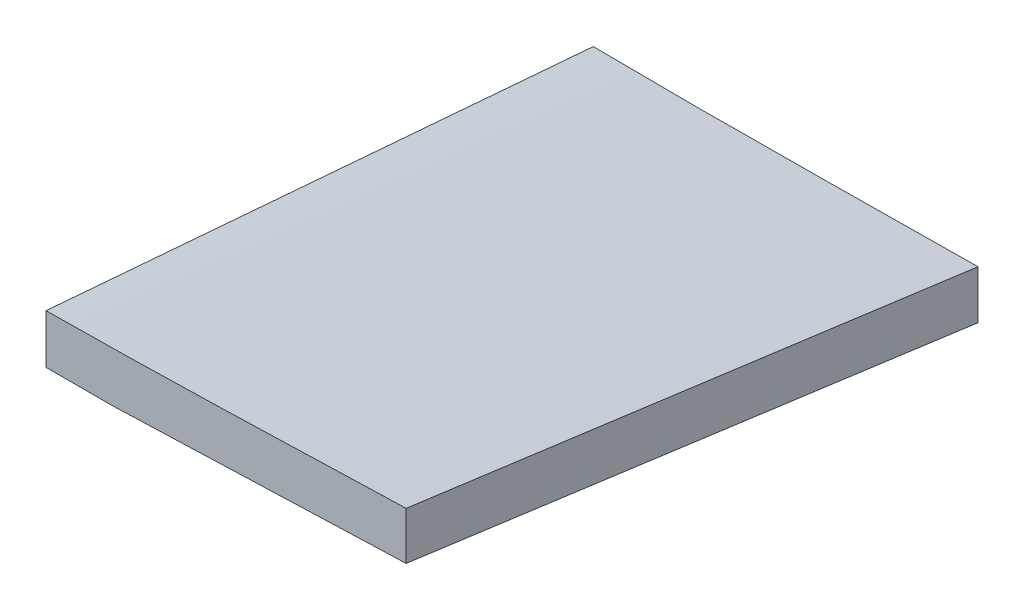
ISO-10303-21;
HEADER;
FILE_DESCRIPTION(('STEP AP214'),'2;1');
FILE_NAME('part.step','',(''),(''),'','','');
FILE_SCHEMA(('AUTOMOTIVE_DESIGN { 1 0 10303 214 1 1 1 1 }'));
ENDSEC;
DATA;
#1=APPLICATION_CONTEXT('core data for automotive mechanical design processes');
#2=APPLICATION_PROTOCOL_DEFINITION('international standard','automotive_design',2000,#1);
#3=PRODUCT_CONTEXT('',#1,'mechanical');
#4=PRODUCT('Part','Part','',(#3));
#5=PRODUCT_RELATED_PRODUCT_CATEGORY('part','',(#4));
#6=PRODUCT_DEFINITION_FORMATION('','',#4);
#7=PRODUCT_DEFINITION_CONTEXT('part definition',#1,'design');
#8=PRODUCT_DEFINITION('design','',#6,#7);
#9=PRODUCT_DEFINITION_SHAPE('','',#8);
#10=(LENGTH_UNIT() NAMED_UNIT(*) SI_UNIT(.MILLI.,.METRE.));
#11=(NAMED_UNIT(*) PLANE_ANGLE_UNIT() SI_UNIT($,.RADIAN.));
#12=(NAMED_UNIT(*) SI_UNIT($,.STERADIAN.) SOLID_ANGLE_UNIT());
#13=UNCERTAINTY_MEASURE_WITH_UNIT(LENGTH_MEASURE(1.E-05),#10,'distance_accuracy_value','');
#14=(GEOMETRIC_REPRESENTATION_CONTEXT(3) GLOBAL_UNCERTAINTY_ASSIGNED_CONTEXT((#13)) GLOBAL_UNIT_ASSIGNED_CONTEXT((#10,
#11,#12)) REPRESENTATION_CONTEXT('',''));
#15=CARTESIAN_POINT('',(0.,0.,0.));
#16=DIRECTION('',(0.,0.,1.));
#17=DIRECTION('',(1.,0.,0.));
#18=AXIS2_PLACEMENT_3D('',#15,#16,#17);
#19=CARTESIAN_POINT('',(122.012987748225,6.34998004884585,335.28));
#20=DIRECTION('',(1.,0.,0.));
#21=DIRECTION('',(0.,1.,0.));
#22=AXIS2_PLACEMENT_3D('',#19,#20,#21);
#23=PLANE('',#22);
#24=CARTESIAN_POINT('',(122.012987748225,-23.8937090007613,335.28));
#25=CARTESIAN_POINT('',(122.012987748225,-21.305492372462,368.512698449762));
#26=CARTESIAN_POINT('',(122.012987748225,-18.7176497078026,401.745426017167));
#27=CARTESIAN_POINT('',(122.012987748225,-15.0260938493232,449.158783166482));
#28=CARTESIAN_POINT('',(122.012987748225,-13.9220747822631,463.339388932419));
#29=CARTESIAN_POINT('',(122.012987748225,-12.8181238056028,477.520000000027));
#30=B_SPLINE_CURVE_WITH_KNOTS('',3,(#24,#25,#26,#27,#28,#29),.UNSPECIFIED.,.F.,.F.,(4,2,4),(0.,
100.000000005188,142.670551230878),.UNSPECIFIED.);
#31=CARTESIAN_POINT('',(122.012987748225,-23.8937090007613,335.28));
#32=VERTEX_POINT('',#31);
#33=CARTESIAN_POINT('',(122.012987748225,-12.8181238056028,477.520000000027));
#34=VERTEX_POINT('',#33);
#35=EDGE_CURVE('E111',#32,#34,#30,.T.);
#36=ORIENTED_EDGE('',*,*,#35,.T.);
#37=DIRECTION('',(0.,1.,0.));
#38=VECTOR('',#37,1.);
#39=CARTESIAN_POINT('',(122.012987748225,6.34998004884585,477.52));
#40=LINE('',#39,#38);
#41=CARTESIAN_POINT('',(122.012987748225,-0.0526370502863598,477.520000000027));
#42=VERTEX_POINT('',#41);
#43=EDGE_CURVE('E242',#34,#42,#40,.T.);
#44=ORIENTED_EDGE('',*,*,#43,.T.);
#45=CARTESIAN_POINT('',(122.012987748225,-0.0526370502863598,477.520000000027));
#46=CARTESIAN_POINT('',(122.012987748225,-1.99784415755209,453.813280448504));
#47=CARTESIAN_POINT('',(122.012987748225,-3.94337341776708,430.106587339408));
#48=CARTESIAN_POINT('',(122.012987748225,-7.83507624409556,382.693254006065));
#49=CARTESIAN_POINT('',(122.012987748225,-9.78124981020904,358.98661378182));
#50=CARTESIAN_POINT('',(122.012987748225,-11.7277455292718,335.28));
#51=B_SPLINE_CURVE_WITH_KNOTS('',3,(#45,#46,#47,#48,#49,#50),.UNSPECIFIED.,.F.,.F.,(4,2,4),(0.,
71.3591720834908,142.718344166981),.UNSPECIFIED.);
#52=CARTESIAN_POINT('',(122.012988297116,-11.727701160406,335.28));
#53=VERTEX_POINT('',#52);
#54=EDGE_CURVE('E106',#42,#53,#51,.T.);
#55=ORIENTED_EDGE('',*,*,#54,.T.);
#56=DIRECTION('',(0.,1.,0.));
#57=VECTOR('',#56,1.);
#58=CARTESIAN_POINT('',(122.012987748225,-11.515890039431,335.28));
#59=LINE('',#58,#57);
#60=EDGE_CURVE('E122',#32,#53,#59,.T.);
#61=ORIENTED_EDGE('',*,*,#60,.F.);
#62=EDGE_LOOP('',(#36,#44,#55,#61));
#63=FACE_BOUND('',#62,.T.);
#64=ADVANCED_FACE('F44',(#63),#23,.F.);
#65=CARTESIAN_POINT('',(0.,0.,477.52));
#66=DIRECTION('',(0.,0.,-1.));
#67=DIRECTION('',(-1.,0.,0.));
#68=AXIS2_PLACEMENT_3D('',#65,#66,#67);
#69=PLANE('',#68);
#70=DIRECTION('',(1.,0.,0.));
#71=VECTOR('',#70,1.);
#72=CARTESIAN_POINT('',(114.323209263802,-12.8181238056049,477.52));
#73=LINE('',#72,#71);
#74=CARTESIAN_POINT('',(139.3232092638,-12.8181238056026,477.520000000029));
#75=VERTEX_POINT('',#74);
#76=EDGE_CURVE('E233',#34,#75,#73,.T.);
#77=ORIENTED_EDGE('',*,*,#76,.T.);
#78=CARTESIAN_POINT('',(139.323209263802,-12.8181238056049,477.52));
#79=CARTESIAN_POINT('',(146.245514006947,-12.5759223842232,477.52));
#80=CARTESIAN_POINT('',(153.167818750092,-12.3337209628415,477.52));
#81=CARTESIAN_POINT('',(167.012428236382,-11.8493181200781,477.52));
#82=CARTESIAN_POINT('',(173.934732979527,-11.6071166986964,477.52));
#83=CARTESIAN_POINT('',(192.445330995778,-10.9594576723294,477.52));
#84=CARTESIAN_POINT('',(204.033624268884,-10.554000067344,477.52));
#85=CARTESIAN_POINT('',(215.621917541989,-10.1485424623587,477.52));
#86=B_SPLINE_CURVE_WITH_KNOTS('',3,(#78,#79,#80,#81,#82,#83,#84,#85),.UNSPECIFIED.,.F.,.F.,(4,2,
2,4),(0.,20.7796217571299,41.5592435142597,76.3453963868684),.UNSPECIFIED.);
#87=CARTESIAN_POINT('',(215.621917541989,-10.1485424623587,477.52));
#88=VERTEX_POINT('',#87);
#89=EDGE_CURVE('E117',#75,#88,#86,.T.);
#90=ORIENTED_EDGE('',*,*,#89,.T.);
#91=DIRECTION('',(0.,1.,0.));
#92=VECTOR('',#91,1.);
#93=CARTESIAN_POINT('',(215.62191754199,-23.8937090007613,477.52));
#94=LINE('',#93,#92);
#95=CARTESIAN_POINT('',(215.621917541989,2.25574454634471,477.52));
#96=VERTEX_POINT('',#95);
#97=EDGE_CURVE('E114',#88,#96,#94,.T.);
#98=ORIENTED_EDGE('',*,*,#97,.T.);
#99=CARTESIAN_POINT('',(215.621917541989,2.25574454634471,477.52));
#100=CARTESIAN_POINT('',(214.647044605365,2.224288392323,477.52));
#101=CARTESIAN_POINT('',(213.67216500944,2.19303949664612,477.52));
#102=CARTESIAN_POINT('',(211.722394914279,2.13088505525722,477.52));
#103=CARTESIAN_POINT('',(210.747504415045,2.09997950952898,477.52));
#104=CARTESIAN_POINT('',(208.797715604077,2.03844062258157,477.52));
#105=CARTESIAN_POINT('',(207.82281729235,2.00780728114808,477.52));
#106=CARTESIAN_POINT('',(205.873014622828,1.94673327865421,477.52));
#107=CARTESIAN_POINT('',(204.898110265033,1.91629261759682,477.52));
#108=CARTESIAN_POINT('',(201.973390033636,1.82523005415367,477.52));
#109=CARTESIAN_POINT('',(200.023566075061,1.76486754230643,477.52));
#110=CARTESIAN_POINT('',(196.123895541607,1.64489301308431,477.52));
#111=CARTESIAN_POINT('',(194.174048966735,1.58528099552785,477.52));
#112=CARTESIAN_POINT('',(190.274399309307,1.46677611513231,477.52));
#113=CARTESIAN_POINT('',(188.324596227481,1.40788322828511,477.52));
#114=CARTESIAN_POINT('',(184.42496974022,1.29073730791751,477.52));
#115=CARTESIAN_POINT('',(182.475146334773,1.23248427475644,477.52));
#116=CARTESIAN_POINT('',(179.550393645504,1.14566147571709,477.52));
#117=CARTESIAN_POINT('',(178.575472624049,1.1168133190096,477.52));
#118=CARTESIAN_POINT('',(176.625625349061,1.0592944631072,477.52));
#119=CARTESIAN_POINT('',(175.650699095529,1.0306237639128,477.52));
#120=CARTESIAN_POINT('',(172.725900323917,0.945169580461794,477.52));
#121=CARTESIAN_POINT('',(170.776011391535,0.888944118170222,477.52));
#122=CARTESIAN_POINT('',(166.875956369448,0.77899210724675,477.52));
#123=CARTESIAN_POINT('',(164.925790272231,0.72526582335519,477.52));
#124=CARTESIAN_POINT('',(161.025365213215,0.621389081226013,477.52));
#125=CARTESIAN_POINT('',(159.075106251561,0.571238617557935,477.52));
#126=CARTESIAN_POINT('',(155.174486893242,0.47532787099128,477.52));
#127=CARTESIAN_POINT('',(153.224126496968,0.429567572283645,477.52));
#128=CARTESIAN_POINT('',(149.323298336082,0.343127637481132,477.52));
#129=CARTESIAN_POINT('',(147.372830571813,0.30244798599696,477.52));
#130=CARTESIAN_POINT('',(143.471732392745,0.226864321897372,477.52));
#131=CARTESIAN_POINT('',(141.521101975046,0.191960458572466,477.52));
#132=CARTESIAN_POINT('',(137.619739338344,0.127837378134033,477.52));
#133=CARTESIAN_POINT('',(135.669007118928,0.098618186243909,477.52));
#134=CARTESIAN_POINT('',(131.767444825237,0.0457651582251589,477.52));
#135=CARTESIAN_POINT('',(129.81661475011,0.0221313848305931,477.52));
#136=CARTESIAN_POINT('',(126.890307741431,-0.00911154197840539,477.52));
#137=CARTESIAN_POINT('',(125.914852880334,-0.0188246312667157,477.52));
#138=CARTESIAN_POINT('',(123.963929885645,-0.0368154889645691,477.52));
#139=CARTESIAN_POINT('',(122.988461752051,-0.0450932573088259,477.52));
#140=CARTESIAN_POINT('',(122.012987748173,-0.052637050288963,477.52));
#141=B_SPLINE_CURVE_WITH_KNOTS('',3,(#99,#100,#101,#102,#103,#104,#105,#106,#107,#108,#109,#110,
#111,#112,#113,#114,#115,#116,#117,#118,#119,#120,#121,#122,#123,#124,#125,#126,#127,#128,#129,
#130,#131,#132,#133,#134,#135,#136,#137,#138,#139,#140),.UNSPECIFIED.,.F.,.F.,(4,2,2,2,2,2,2,2,
2,2,2,2,2,2,2,2,2,2,2,2,4),(0.,2.92614084149174,5.85228154467963,8.77841994370649,
11.7045583880756,17.5568324945537,23.4091051850171,29.2611819606866,35.1132620224934,
38.0393052238479,40.9653484336475,46.8174456482294,52.6701613758528,58.5228682149949,
64.375553977651,70.2282220120763,76.0810413005542,81.9338865579291,87.7867975499124,
90.7133063005583,93.6398151843176),.UNSPECIFIED.);
#142=EDGE_CURVE('E101',#96,#42,#141,.T.);
#143=ORIENTED_EDGE('',*,*,#142,.T.);
#144=ORIENTED_EDGE('',*,*,#43,.F.);
#145=EDGE_LOOP('',(#77,#90,#98,#143,#144));
#146=FACE_BOUND('',#145,.T.);
#147=ADVANCED_FACE('F116',(#146),#69,.F.);
#148=CARTESIAN_POINT('',(200.92741848358,-11.515890039431,335.28));
#149=DIRECTION('',(0.,0.,1.));
#150=DIRECTION('',(1.,0.,0.));
#151=AXIS2_PLACEMENT_3D('',#148,#149,#150);
#152=PLANE('',#151);
#153=DIRECTION('',(-1.,0.,0.));
#154=VECTOR('',#153,1.);
#155=CARTESIAN_POINT('',(148.93082104307,-23.8937090007613,335.28));
#156=LINE('',#155,#154);
#157=CARTESIAN_POINT('',(148.93082104307,-23.8937090007613,335.28));
#158=VERTEX_POINT('',#157);
#159=EDGE_CURVE('E164',#158,#32,#156,.T.);
#160=ORIENTED_EDGE('',*,*,#159,.T.);
#161=ORIENTED_EDGE('',*,*,#60,.T.);
#162=CARTESIAN_POINT('',(49.0219891897218,-9.05897370885618,335.28));
#163=CARTESIAN_POINT('',(52.7488075915908,-9.37968687905642,335.28));
#164=CARTESIAN_POINT('',(61.5486245889691,-10.0060219878456,335.28));
#165=CARTESIAN_POINT('',(75.4340137435764,-10.6804188841519,335.28));
#166=CARTESIAN_POINT('',(95.7508728354299,-11.2827277231481,335.28));
#167=CARTESIAN_POINT('',(121.162052376226,-11.7896131541079,335.28));
#168=CARTESIAN_POINT('',(150.889153507633,-11.9577234273644,335.28));
#169=CARTESIAN_POINT('',(170.450484189727,-11.8089552152556,335.28));
#170=CARTESIAN_POINT('',(179.841619958646,-11.723553664972,335.28));
#171=B_SPLINE_CURVE_WITH_KNOTS('',3,(#162,#163,#164,#165,#166,#167,#168,#169,#170),
.UNSPECIFIED.,.F.,.F.,(4,1,1,1,1,1,4),(0.589081134929683,0.607134741746914,0.631652079836766,
0.656174271859652,0.705233949250519,0.754320378530032,0.799648231212389),.UNSPECIFIED.);
#172=CARTESIAN_POINT('',(179.841619958646,-11.723553664972,335.28));
#173=VERTEX_POINT('',#172);
#174=EDGE_CURVE('E59',#53,#173,#171,.T.);
#175=ORIENTED_EDGE('',*,*,#174,.T.);
#176=CARTESIAN_POINT('',(179.841619958646,-11.723553664972,335.28));
#177=CARTESIAN_POINT('',(180.626661669914,-11.7164132247789,335.28));
#178=CARTESIAN_POINT('',(191.590298029477,-11.615327823903,335.28));
#179=CARTESIAN_POINT('',(205.647342909195,-11.4679823577632,335.28));
#180=CARTESIAN_POINT('',(218.919367509353,-11.3224017932494,335.28));
#181=CARTESIAN_POINT('',(222.012987748225,-11.2872773614073,335.28));
#182=B_SPLINE_CURVE_WITH_KNOTS('',3,(#176,#177,#178,#179,#180,#181),.UNSPECIFIED.,.F.,.F.,(4,1,
1,4),(0.79964823121239,0.803437363555032,0.852566095729537,0.867498350403516),.UNSPECIFIED.);
#183=CARTESIAN_POINT('',(222.012987748225,-11.2872773614074,335.28));
#184=VERTEX_POINT('',#183);
#185=EDGE_CURVE('E11',#173,#184,#182,.T.);
#186=ORIENTED_EDGE('',*,*,#185,.T.);
#187=DIRECTION('',(0.,-1.,0.));
#188=VECTOR('',#187,1.);
#189=CARTESIAN_POINT('',(222.012987748225,-11.2872773614074,335.28));
#190=LINE('',#189,#188);
#191=CARTESIAN_POINT('',(222.012987748225,-23.8937090007613,335.28));
#192=VERTEX_POINT('',#191);
#193=EDGE_CURVE('E73',#184,#192,#190,.T.);
#194=ORIENTED_EDGE('',*,*,#193,.T.);
#195=DIRECTION('',(-1.,0.,0.));
#196=VECTOR('',#195,1.);
#197=CARTESIAN_POINT('',(148.93082104307,-23.8937090007613,335.28));
#198=LINE('',#197,#196);
#199=EDGE_CURVE('E248',#192,#158,#198,.T.);
#200=ORIENTED_EDGE('',*,*,#199,.T.);
#201=EDGE_LOOP('',(#160,#161,#175,#186,#194,#200));
#202=FACE_BOUND('',#201,.T.);
#203=ADVANCED_FACE('F222',(#202),#152,.F.);
#204=CARTESIAN_POINT('',(222.012987748225,-23.8937090007613,335.28));
#205=DIRECTION('',(0.998992101682105,0.,0.0448863094581294));
#206=DIRECTION('',(0.,1.,0.));
#207=AXIS2_PLACEMENT_3D('',#204,#205,#206);
#208=PLANE('',#207);
#209=ORIENTED_EDGE('',*,*,#97,.F.);
#210=CARTESIAN_POINT('',(222.012987748225,-23.8937090007613,335.28));
#211=CARTESIAN_POINT('',(215.621950375233,-10.1464646900732,477.519269261564));
#212=CARTESIAN_POINT('',(209.230888497717,3.59504253956158,619.759083897143));
#213=CARTESIAN_POINT('',(202.839777129521,17.3249682784286,762.));
#214=B_SPLINE_CURVE_WITH_KNOTS('',3,(#210,#211,#212,#213),.UNSPECIFIED.,.F.,.F.,(4,4),(0.,1.),.UNSPECIFIED.);
#215=EDGE_CURVE('E127',#192,#88,#214,.T.);
#216=ORIENTED_EDGE('',*,*,#215,.F.);
#217=ORIENTED_EDGE('',*,*,#193,.F.);
#218=CARTESIAN_POINT('',(222.012987748225,-11.2872773614073,335.28));
#219=CARTESIAN_POINT('',(215.621950375233,2.25782306949605,477.519269261564));
#220=CARTESIAN_POINT('',(209.230888497717,15.7971864193462,619.759083897143));
#221=CARTESIAN_POINT('',(202.839777129521,29.3249682784286,762.));
#222=B_SPLINE_CURVE_WITH_KNOTS('',3,(#218,#219,#220,#221),.UNSPECIFIED.,.F.,.F.,(4,4),(0.,1.),.UNSPECIFIED.);
#223=EDGE_CURVE('E67',#184,#96,#222,.T.);
#224=ORIENTED_EDGE('',*,*,#223,.T.);
#225=EDGE_LOOP('',(#209,#216,#217,#224));
#226=FACE_BOUND('',#225,.T.);
#227=ADVANCED_FACE('F124',(#226),#208,.T.);
#228=CARTESIAN_POINT('',(148.93082104307,-23.8937090007613,335.28));
#229=CARTESIAN_POINT('',(139.323254044884,-12.8160361171643,477.519269261564));
#230=CARTESIAN_POINT('',(129.715662542174,-1.74410031462064,619.759083897143));
#231=CARTESIAN_POINT('',(120.108021548784,9.31625399715528,762.));
#232=CARTESIAN_POINT('',(155.021001601833,-23.8937090007613,335.28));
#233=CARTESIAN_POINT('',(145.68147873908,-12.5935718315734,477.519269261564));
#234=CARTESIAN_POINT('',(136.341931371802,-1.29917174343879,619.759083897143));
#235=CARTESIAN_POINT('',(127.002334513845,9.98364685392806,762.));
#236=CARTESIAN_POINT('',(167.201362719359,-23.8937090007613,335.28));
#237=CARTESIAN_POINT('',(158.397928127471,-12.1486432603916,477.519269261565));
#238=CARTESIAN_POINT('',(149.59446903106,-0.409314601075073,619.759083897144));
#239=CARTESIAN_POINT('',(140.790960443968,11.3184325674736,762.));
#240=CARTESIAN_POINT('',(185.471904395647,-23.8937090007613,335.28));
#241=CARTESIAN_POINT('',(177.472602210058,-11.4812504036188,477.519269261564));
#242=CARTESIAN_POINT('',(169.473275519945,0.925471112470457,619.759083897143));
#243=CARTESIAN_POINT('',(161.473899339152,13.3206111377919,762.));
#244=CARTESIAN_POINT('',(203.742446071936,-23.8937090007613,335.28));
#245=CARTESIAN_POINT('',(196.547276292646,-10.813857546846,477.519269261564));
#246=CARTESIAN_POINT('',(189.352082008831,2.26025682601603,619.759083897143));
#247=CARTESIAN_POINT('',(182.156838234336,15.3227897081103,761.999999999999));
#248=CARTESIAN_POINT('',(215.922807189462,-23.8937090007613,335.28));
#249=CARTESIAN_POINT('',(209.263725681037,-10.3689289756642,477.519269261564));
#250=CARTESIAN_POINT('',(202.604619668088,3.15011396837973,619.759083897143));
#251=CARTESIAN_POINT('',(195.945464164459,16.6575754216558,762.));
#252=CARTESIAN_POINT('',(222.012987748225,-23.8937090007613,335.28));
#253=CARTESIAN_POINT('',(215.621950375233,-10.1464646900732,477.519269261564));
#254=CARTESIAN_POINT('',(209.230888497717,3.59504253956158,619.759083897143));
#255=CARTESIAN_POINT('',(202.839777129521,17.3249682784286,762.));
#256=B_SPLINE_SURFACE_WITH_KNOTS('',3,3,((#228,#229,#230,#231),(#232,#233,#234,#235),(#236,#237,
#238,#239),(#240,#241,#242,#243),(#244,#245,#246,#247),(#248,#249,#250,#251),(#252,#253,#254,
#255)),.UNSPECIFIED.,.F.,.F.,.F.,(4,1,1,1,4),(4,4),(0.796773836641175,0.840719353183708,
0.884664869726241,0.928610386268774,0.972555902811307),(0.,1.),.UNSPECIFIED.);
#257=CARTESIAN_POINT('',(148.93082104307,-23.8937090007613,335.28));
#258=CARTESIAN_POINT('',(139.323254044884,-12.8160361171643,477.519269261564));
#259=CARTESIAN_POINT('',(129.715662542174,-1.74410031462064,619.759083897143));
#260=CARTESIAN_POINT('',(120.108021548784,9.31625399715528,762.));
#261=B_SPLINE_CURVE_WITH_KNOTS('',3,(#257,#258,#259,#260),.UNSPECIFIED.,.F.,.F.,(4,4),(0.,1.),.UNSPECIFIED.);
#262=EDGE_CURVE('E131',#158,#75,#261,.T.);
#263=ORIENTED_EDGE('',*,*,#89,.F.);
#264=ORIENTED_EDGE('',*,*,#262,.F.);
#265=ORIENTED_EDGE('',*,*,#199,.F.);
#266=ORIENTED_EDGE('',*,*,#215,.T.);
#267=EDGE_LOOP('',(#263,#264,#265,#266));
#268=FACE_BOUND('',#267,.T.);
#269=ADVANCED_FACE('F181',(#268),#256,.T.);
#270=CARTESIAN_POINT('',(98.93082104307,-23.8937090007613,335.28));
#271=CARTESIAN_POINT('',(89.323254044884,-12.8160361171643,477.519269261564));
#272=CARTESIAN_POINT('',(79.7156625421738,-1.74410031462064,619.759083897143));
#273=CARTESIAN_POINT('',(70.1080215487835,9.31625399715528,762.));
#274=CARTESIAN_POINT('',(103.097487709737,-23.8937090007613,335.28));
#275=CARTESIAN_POINT('',(93.4899207115506,-12.8160361171643,477.519269261564));
#276=CARTESIAN_POINT('',(83.8823292088405,-1.74410031462064,619.759083897143));
#277=CARTESIAN_POINT('',(74.2746882154502,9.31625399715528,762.));
#278=CARTESIAN_POINT('',(111.43082104307,-23.8937090007613,335.28));
#279=CARTESIAN_POINT('',(101.823254044884,-12.8160361171643,477.519269261564));
#280=CARTESIAN_POINT('',(92.2156625421738,-1.74410031462064,619.759083897143));
#281=CARTESIAN_POINT('',(82.6080215487835,9.31625399715527,762.));
#282=CARTESIAN_POINT('',(123.93082104307,-23.8937090007613,335.280000000001));
#283=CARTESIAN_POINT('',(114.323254044884,-12.8160361171644,477.519269261565));
#284=CARTESIAN_POINT('',(104.715662542174,-1.74410031462064,619.759083897144));
#285=CARTESIAN_POINT('',(95.1080215487836,9.3162539971553,762.000000000001));
#286=CARTESIAN_POINT('',(136.43082104307,-23.8937090007613,335.279999999999));
#287=CARTESIAN_POINT('',(126.823254044884,-12.8160361171643,477.519269261564));
#288=CARTESIAN_POINT('',(117.215662542174,-1.74410031462065,619.759083897143));
#289=CARTESIAN_POINT('',(107.608021548783,9.31625399715526,761.999999999999));
#290=CARTESIAN_POINT('',(144.764154376403,-23.8937090007613,335.28));
#291=CARTESIAN_POINT('',(135.156587378217,-12.8160361171643,477.519269261564));
#292=CARTESIAN_POINT('',(125.548995875507,-1.74410031462064,619.759083897143));
#293=CARTESIAN_POINT('',(115.941354882117,9.31625399715528,762.));
#294=CARTESIAN_POINT('',(148.93082104307,-23.8937090007613,335.28));
#295=CARTESIAN_POINT('',(139.323254044884,-12.8160361171643,477.519269261564));
#296=CARTESIAN_POINT('',(129.715662542174,-1.74410031462064,619.759083897143));
#297=CARTESIAN_POINT('',(120.108021548784,9.31625399715528,762.));
#298=B_SPLINE_SURFACE_WITH_KNOTS('',3,3,((#270,#271,#272,#273),(#274,#275,#276,#277),(#278,#279,
#280,#281),(#282,#283,#284,#285),(#286,#287,#288,#289),(#290,#291,#292,#293),(#294,#295,#296,
#297)),.UNSPECIFIED.,.F.,.F.,.F.,(4,1,1,1,4),(4,4),(0.684963327266946,0.712915954610504,
0.740868581954061,0.768821209297618,0.796773836641175),(0.,1.),.UNSPECIFIED.);
#299=ORIENTED_EDGE('',*,*,#76,.F.);
#300=ORIENTED_EDGE('',*,*,#35,.F.);
#301=ORIENTED_EDGE('',*,*,#159,.F.);
#302=ORIENTED_EDGE('',*,*,#262,.T.);
#303=EDGE_LOOP('',(#299,#300,#301,#302));
#304=FACE_BOUND('',#303,.T.);
#305=ADVANCED_FACE('F46',(#304),#298,.T.);
#306=CARTESIAN_POINT('',(222.012987748225,-11.2872773614073,335.28));
#307=CARTESIAN_POINT('',(215.621950375233,2.25782306949605,477.519269261564));
#308=CARTESIAN_POINT('',(209.230888497717,15.7971864193462,619.759083897143));
#309=CARTESIAN_POINT('',(202.839777129521,29.3249682784286,762.));
#310=CARTESIAN_POINT('',(218.569474026706,-11.3263744236417,335.28));
#311=CARTESIAN_POINT('',(212.364886061197,2.15272535408958,477.519269261564));
#312=CARTESIAN_POINT('',(206.160273591164,15.6260880507676,619.759083897143));
#313=CARTESIAN_POINT('',(199.955611630451,29.0878692566778,762.));
#314=CARTESIAN_POINT('',(211.614338336714,-11.4024470677598,335.28));
#315=CARTESIAN_POINT('',(205.825097972641,1.94636141574157,477.519269261565));
#316=CARTESIAN_POINT('',(200.035833104044,15.2894328181897,619.759083897143));
#317=CARTESIAN_POINT('',(194.246518744766,28.62092272987,762.));
#318=CARTESIAN_POINT('',(201.046202820784,-11.5155355801604,335.28));
#319=CARTESIAN_POINT('',(195.960183316022,1.64100708519495,477.519269261564));
#320=CARTESIAN_POINT('',(190.874139306737,14.791812669497,619.759083897143));
#321=CARTESIAN_POINT('',(185.788045806771,27.9310367630314,762.));
#322=CARTESIAN_POINT('',(190.421562401009,-11.6239646215105,335.28));
#323=CARTESIAN_POINT('',(186.071163978279,1.34135026762067,477.519269261564));
#324=CARTESIAN_POINT('',(181.720741051026,14.3009280756986,619.759083897143));
#325=CARTESIAN_POINT('',(177.370268633092,27.2489243930088,761.999999999999));
#326=CARTESIAN_POINT('',(183.356302448994,-11.6915854526342,335.28));
#327=CARTESIAN_POINT('',(179.48576660961,1.1454855942834,477.519269261564));
#328=CARTESIAN_POINT('',(175.615206265701,13.9768195601478,619.759083897143));
#329=CARTESIAN_POINT('',(171.744596431112,26.7965720352444,762.));
#330=CARTESIAN_POINT('',(174.388523129358,-11.7731432923107,335.28));
#331=CARTESIAN_POINT('',(171.103001578197,0.899059371477806,477.519269261564));
#332=CARTESIAN_POINT('',(167.817455522512,13.5655249542131,619.759083897143));
#333=CARTESIAN_POINT('',(164.531859976147,26.2204090461806,762.));
#334=CARTESIAN_POINT('',(163.489709248502,-11.8633262155867,335.28));
#335=CARTESIAN_POINT('',(160.910936734288,0.60773809662375,477.519269261564));
#336=CARTESIAN_POINT('',(158.33213971555,13.073065327781,619.759083897143));
#337=CARTESIAN_POINT('',(155.753293206132,25.5268110681705,761.999999999999));
#338=CARTESIAN_POINT('',(147.154849918996,-11.9140829368556,335.28));
#339=CARTESIAN_POINT('',(145.626036317623,0.251017379627905,477.519269261565));
#340=CARTESIAN_POINT('',(144.097198211725,12.4103806150582,619.759083897144));
#341=CARTESIAN_POINT('',(142.568310615148,24.5581623597207,762.000000000001));
#342=CARTESIAN_POINT('',(133.547087797304,-11.8513571386047,335.28));
#343=CARTESIAN_POINT('',(132.888447204188,0.0521462593199381,477.519269261564));
#344=CARTESIAN_POINT('',(132.229782106547,11.9499125761914,619.759083897143));
#345=CARTESIAN_POINT('',(131.571067518226,23.8360974022951,762.));
#346=CARTESIAN_POINT('',(122.659949238186,-11.7410017797558,335.280000000001));
#347=CARTESIAN_POINT('',(122.697140743006,-0.0501019891075296,477.519269261565));
#348=CARTESIAN_POINT('',(122.734307743302,11.6350607204876,619.759083897143));
#349=CARTESIAN_POINT('',(122.771425252918,23.3086419393149,762.));
#350=CARTESIAN_POINT('',(114.493192339325,-11.6262316691835,335.28));
#351=CARTESIAN_POINT('',(115.052736661929,-0.0970194846432594,477.519269261564));
#352=CARTESIAN_POINT('',(115.612256480008,11.4264556188438,619.759083897143));
#353=CARTESIAN_POINT('',(116.171726807407,22.938349231563,761.999999999999));
#354=CARTESIAN_POINT('',(106.324095444975,-11.4813070111323,335.28));
#355=CARTESIAN_POINT('',(107.407102717467,-0.115334106030914,477.519269261564));
#356=CARTESIAN_POINT('',(108.490085485435,11.2449017180172,619.759083897143));
#357=CARTESIAN_POINT('',(109.573018762723,22.5935560512976,762.));
#358=CARTESIAN_POINT('',(98.1517013141778,-11.3060491598229,335.28));
#359=CARTESIAN_POINT('',(99.7599490935271,-0.105289853007253,477.519269261565));
#360=CARTESIAN_POINT('',(101.368172368352,11.0897323727552,619.759083897144));
#361=CARTESIAN_POINT('',(102.976346152497,22.2731731077499,762.000000000001));
#362=CARTESIAN_POINT('',(89.9750279012389,-11.1021701951475,335.28));
#363=CARTESIAN_POINT('',(92.1109614058318,-0.0686157488297257,477.519269261564));
#364=CARTESIAN_POINT('',(94.2468704059006,10.9592016164349,619.759083897143));
#365=CARTESIAN_POINT('',(96.3827299152893,21.9754374909317,762.));
#366=CARTESIAN_POINT('',(81.7931246917491,-10.8683806880935,335.28));
#367=CARTESIAN_POINT('',(84.4597450626571,-0.00268226262042188,477.519269261565));
#368=CARTESIAN_POINT('',(87.1263409290411,10.8572790817994,619.759083897144));
#369=CARTESIAN_POINT('',(89.7928873047449,21.7056589354515,762.));
#370=CARTESIAN_POINT('',(73.6060212603565,-10.5736728833086,335.279999999999));
#371=CARTESIAN_POINT('',(76.8063043911992,0.122433158677056,477.519269261564));
#372=CARTESIAN_POINT('',(80.0065630175178,10.8128021196095,619.759083897143));
#373=CARTESIAN_POINT('',(83.2067721531562,21.4915895897743,762.));
#374=CARTESIAN_POINT('',(65.4143764421152,-10.1899300133236,335.28));
#375=CARTESIAN_POINT('',(69.1513913096214,0.331870983608891,477.519269261565));
#376=CARTESIAN_POINT('',(72.8883816726035,10.8479348994881,619.759083897144));
#377=CARTESIAN_POINT('',(76.6253225449055,21.3524173245996,762.));
#378=CARTESIAN_POINT('',(57.218819398707,-9.70421420475117,335.28));
#379=CARTESIAN_POINT('',(61.4959487597233,0.637407086376427,477.519269261564));
#380=CARTESIAN_POINT('',(65.7730536162154,10.9732912964508,619.759083897143));
#381=CARTESIAN_POINT('',(70.0501089820274,21.2975940157574,762.));
#382=CARTESIAN_POINT('',(51.753855165005,-9.29406576406763,335.28));
#383=CARTESIAN_POINT('',(56.3933077057463,0.923606423622542,477.519269261564));
#384=CARTESIAN_POINT('',(61.0327357419635,11.1355415302595,619.759083897143));
#385=CARTESIAN_POINT('',(65.6721142875005,21.3358951461287,762.));
#386=CARTESIAN_POINT('',(47.9240317369891,-8.96448844964143,335.28));
#387=CARTESIAN_POINT('',(52.818089020236,1.16404685916252,477.519269261564));
#388=CARTESIAN_POINT('',(57.7121217989589,11.2868450869133,619.759083897143));
#389=CARTESIAN_POINT('',(62.6061050870016,21.3980618238962,762.));
#390=CARTESIAN_POINT('',(45.7218209357501,-8.76534620327357,335.28));
#391=CARTESIAN_POINT('',(50.7660285067419,1.3113655323144,477.519269261564));
#392=CARTESIAN_POINT('',(55.8102115732095,11.3823401868492,619.759083897143));
#393=CARTESIAN_POINT('',(60.8543451489969,21.4417333506161,762.));
#394=CARTESIAN_POINT('',(42.4027754578273,-8.432707682147,335.280000000001));
#395=CARTESIAN_POINT('',(47.6828454316512,1.56346050757602,477.519269261565));
#396=CARTESIAN_POINT('',(52.9628909009511,11.5538916162458,619.759083897144));
#397=CARTESIAN_POINT('',(58.2428868795708,21.5327412341478,762.000000000001));
#398=CARTESIAN_POINT('',(39.0713826541202,-8.06384555902649,335.279999999999));
#399=CARTESIAN_POINT('',(44.5960375014028,1.84855027043535,477.519269261564));
#400=CARTESIAN_POINT('',(50.1206678441612,11.755209018844,619.759083897142));
#401=CARTESIAN_POINT('',(55.6452486962394,21.6502862764848,761.999999999999));
#402=CARTESIAN_POINT('',(35.7310935187291,-7.65734912890353,335.28));
#403=CARTESIAN_POINT('',(41.5071383578781,2.1677625802585,477.519269261565));
#404=CARTESIAN_POINT('',(47.283158692503,11.9871372083673,619.759083897144));
#405=CARTESIAN_POINT('',(53.0591295364477,21.7949303457084,762.000000000001));
#406=CARTESIAN_POINT('',(32.3856911285866,-7.21086412592674,335.28));
#407=CARTESIAN_POINT('',(38.4179939023169,2.52333107982961,477.519269261564));
#408=CARTESIAN_POINT('',(44.4502721715231,12.2517892045327,619.759083897143));
#409=CARTESIAN_POINT('',(50.4825009500491,21.9686658384681,761.999999999999));
#410=CARTESIAN_POINT('',(29.0388190535993,-6.72415739916843,335.28));
#411=CARTESIAN_POINT('',(35.3303071809232,2.91510782511942,477.519269261565));
#412=CARTESIAN_POINT('',(41.621770803723,12.5486359683541,619.759083897143));
#413=CARTESIAN_POINT('',(47.9131849358426,22.1705826208209,762.));
#414=CARTESIAN_POINT('',(25.6949743291155,-6.19196852419016,335.28));
#415=CARTESIAN_POINT('',(32.2467004538082,3.35008801111173,477.519269261565));
#416=CARTESIAN_POINT('',(38.7984020739767,12.8864074653604,619.759083897144));
#417=CARTESIAN_POINT('',(45.3500542034651,22.4111454288413,762.000000000001));
#418=CARTESIAN_POINT('',(22.9174344404017,-5.69180499526552,335.28));
#419=CARTESIAN_POINT('',(29.6847215388951,3.76530583704974,477.519269261564));
#420=CARTESIAN_POINT('',(36.4519841328644,13.2166795883118,619.759083897143));
#421=CARTESIAN_POINT('',(43.2191972361536,22.656471848806,761.999999999999));
#422=CARTESIAN_POINT('',(20.7051166447645,-5.24830690376412,335.28));
#423=CARTESIAN_POINT('',(27.6427855448402,4.13795801459049,477.519269261564));
#424=CARTESIAN_POINT('',(34.5804299403918,13.5184858518919,619.759083897144));
#425=CARTESIAN_POINT('',(41.5180248452633,22.8874321984255,762.));
#426=CARTESIAN_POINT('',(19.0522311011638,-4.89036823785229,335.28));
#427=CARTESIAN_POINT('',(26.1162869738974,4.44099244551772,477.519269261565));
#428=CARTESIAN_POINT('',(33.1803183421069,13.7666160478345,619.759083897144));
#429=CARTESIAN_POINT('',(40.2443002196361,23.0806581593835,762.000000000001));
#430=CARTESIAN_POINT('',(17.4072680026639,-4.50393109256964,335.28));
#431=CARTESIAN_POINT('',(24.5959209475556,4.77057979291317,477.519269261564));
#432=CARTESIAN_POINT('',(31.7845493879232,14.0393535973428,619.759083897143));
#433=CARTESIAN_POINT('',(38.9731283376106,23.2965459110046,761.999999999999));
#434=CARTESIAN_POINT('',(15.7719559277294,-4.08585733946278,335.279999999999));
#435=CARTESIAN_POINT('',(23.0830306833606,5.12953181584458,477.519269261564));
#436=CARTESIAN_POINT('',(30.3940809344676,14.3391838900987,619.759083897143));
#437=CARTESIAN_POINT('',(37.7050816948944,23.5372544735851,762.));
#438=CARTESIAN_POINT('',(14.1482110615158,-3.63320964201411,335.28));
#439=CARTESIAN_POINT('',(21.5791210658283,5.52064217750062,477.519269261565));
#440=CARTESIAN_POINT('',(29.0100065656166,14.6687569159621,619.759083897144));
#441=CARTESIAN_POINT('',(36.4408425747248,23.8052901636559,762.));
#442=CARTESIAN_POINT('',(12.5379887560416,-3.14346189168235,335.28));
#443=CARTESIAN_POINT('',(20.0857854765168,5.94643031634065,477.519269261564));
#444=CARTESIAN_POINT('',(27.6335576924679,15.0305854433104,619.759083897143));
#445=CARTESIAN_POINT('',(35.1812804177387,24.1031590795125,762.));
#446=CARTESIAN_POINT('',(10.9443022314088,-2.61171665583038,335.28));
#447=CARTESIAN_POINT('',(18.6055358798854,6.41151219142834,477.519269261564));
#448=CARTESIAN_POINT('',(26.2667450238378,15.4290039576339,619.759083897143));
#449=CARTESIAN_POINT('',(33.92790467711,24.4349142330716,762.));
#450=CARTESIAN_POINT('',(9.3696983908296,-2.03559280479495,335.28));
#451=CARTESIAN_POINT('',(17.140516523627,6.9183980534325,477.519269261565));
#452=CARTESIAN_POINT('',(24.9113101519002,15.8666518306067,619.759083897144));
#453=CARTESIAN_POINT('',(32.6820542894933,24.8033241170132,762.));
#454=CARTESIAN_POINT('',(7.81930606312509,-1.40676584170021,335.28));
#455=CARTESIAN_POINT('',(15.6951423376886,7.47472087107555,477.519269261564));
#456=CARTESIAN_POINT('',(23.5709541077281,16.3504705027981,619.759083897143));
#457=CARTESIAN_POINT('',(31.4467163870874,25.2146386437529,761.999999999999));
#458=CARTESIAN_POINT('',(6.2945427283012,-0.728623104338553,335.28));
#459=CARTESIAN_POINT('',(14.270722157368,8.07829784576766,477.519269261565));
#460=CARTESIAN_POINT('',(22.2468770819107,16.8794817148207,619.759083897144));
#461=CARTESIAN_POINT('',(30.2229825157733,25.6690840931059,762.000000000001));
#462=CARTESIAN_POINT('',(4.81910701938389,0.0452105722964347,335.28));
#463=CARTESIAN_POINT('',(12.8897475080532,8.77532558765721,477.519269261564));
#464=CARTESIAN_POINT('',(20.9603634921985,17.4997035219648,619.759083897142));
#465=CARTESIAN_POINT('',(29.0309299856635,26.2124999655045,761.999999999998));
#466=CARTESIAN_POINT('',(3.44019696912771,0.973032127436344,335.28));
#467=CARTESIAN_POINT('',(11.5941800006254,9.61860132023108,477.519269261566));
#468=CARTESIAN_POINT('',(19.748138527599,18.2584334319726,619.759083897145));
#469=CARTESIAN_POINT('',(27.9020475638924,26.8866840529463,762.000000000003));
#470=CARTESIAN_POINT('',(2.18607039010745,2.05737434257256,335.28));
#471=CARTESIAN_POINT('',(10.4107564395223,10.6111710650528,477.519269261563));
#472=CARTESIAN_POINT('',(18.6354179844131,19.1592307064798,619.759083897141));
#473=CARTESIAN_POINT('',(26.8600300386238,27.6957088571391,761.999999999997));
#474=CARTESIAN_POINT('',(1.27839650729546,3.09358418996593,335.28));
#475=CARTESIAN_POINT('',(9.54912891024288,11.5662188458673,477.519269261565));
#476=CARTESIAN_POINT('',(17.8198368086662,20.0331164207154,619.759083897144));
#477=CARTESIAN_POINT('',(26.0904952164094,28.4884325047958,762.000000000001));
#478=CARTESIAN_POINT('',(0.675104053522571,4.01206497822802,335.28));
#479=CARTESIAN_POINT('',(8.9756319822023,12.418850021307,477.519269261564));
#480=CARTESIAN_POINT('',(17.2761354063579,20.8198979833327,619.759083897143));
#481=CARTESIAN_POINT('',(25.5765893398334,29.2093644545907,761.999999999999));
#482=CARTESIAN_POINT('',(0.311283524258083,4.74838484159257,335.28));
#483=CARTESIAN_POINT('',(8.62885568345465,13.1054382128106,477.519269261565));
#484=CARTESIAN_POINT('',(16.9464033381271,21.4567545029755,619.759083897144));
#485=CARTESIAN_POINT('',(25.2639015021194,29.7964893023725,762.));
#486=CARTESIAN_POINT('',(0.0633372908855968,5.53486679411943,335.28));
#487=CARTESIAN_POINT('',(8.3922174754818,13.8408332089873,477.519269261564));
#488=CARTESIAN_POINT('',(16.7210731555539,22.141062542802,619.759083897143));
#489=CARTESIAN_POINT('',(25.0498793449458,30.4297103858489,761.999999999999));
#490=CARTESIAN_POINT('',(9.29076906829817E-07,6.07768392100159,335.28));
#491=CARTESIAN_POINT('',(8.3334947321307,14.3508356613562,477.519269261564));
#492=CARTESIAN_POINT('',(16.6669640306604,22.6182503206576,619.759083897143));
#493=CARTESIAN_POINT('',(25.0003838385099,30.8740834891911,762.));
#494=CARTESIAN_POINT('',(9.29077044083409E-07,6.34998004884586,335.28));
#495=CARTESIAN_POINT('',(8.33349473213078,14.6065062308661,477.519269261564));
#496=CARTESIAN_POINT('',(16.6669640306604,22.8572953318332,619.759083897143));
#497=CARTESIAN_POINT('',(25.0003838385099,31.0965029420325,762.));
#498=B_SPLINE_SURFACE_WITH_KNOTS('',3,3,((#306,#307,#308,#309),(#310,#311,#312,#313),(#314,#315,
#316,#317),(#318,#319,#320,#321),(#322,#323,#324,#325),(#326,#327,#328,#329),(#330,#331,#332,
#333),(#334,#335,#336,#337),(#338,#339,#340,#341),(#342,#343,#344,#345),(#346,#347,#348,#349),
(#350,#351,#352,#353),(#354,#355,#356,#357),(#358,#359,#360,#361),(#362,#363,#364,#365),(#366,
#367,#368,#369),(#370,#371,#372,#373),(#374,#375,#376,#377),(#378,#379,#380,#381),(#382,#383,
#384,#385),(#386,#387,#388,#389),(#390,#391,#392,#393),(#394,#395,#396,#397),(#398,#399,#400,
#401),(#402,#403,#404,#405),(#406,#407,#408,#409),(#410,#411,#412,#413),(#414,#415,#416,#417),
(#418,#419,#420,#421),(#422,#423,#424,#425),(#426,#427,#428,#429),(#430,#431,#432,#433),(#434,
#435,#436,#437),(#438,#439,#440,#441),(#442,#443,#444,#445),(#446,#447,#448,#449),(#450,#451,
#452,#453),(#454,#455,#456,#457),(#458,#459,#460,#461),(#462,#463,#464,#465),(#466,#467,#468,
#469),(#470,#471,#472,#473),(#474,#475,#476,#477),(#478,#479,#480,#481),(#482,#483,#484,#485),
(#486,#487,#488,#489),(#490,#491,#492,#493),(#494,#495,#496,#497)),.UNSPECIFIED.,.F.,.F.,.F.,(4,
1,1,1,2,1,1,1,1,1,1,1,1,1,1,1,1,2,1,1,1,1,1,1,1,1,1,1,1,1,1,1,1,1,1,1,1,1,1,1,1,1,1,4),(4,4),
(0.,0.0210721432720827,0.0421442865441653,0.063216429816248,0.0842885730883306,
0.116982404956549,0.149676236824766,0.182370068692984,0.198716984627093,0.215063900561202,
0.231410816495311,0.24775773242942,0.264104648363529,0.280451564297638,0.296798480231747,
0.313145396165856,0.329492312099965,0.345839228034074,0.352409679753848,0.358980131473621,
0.365550583193395,0.372121034913169,0.378691486632943,0.385261938352717,0.39183239007249,
0.398402841792264,0.401688067652151,0.404973293512038,0.408258519371925,0.411543745231812,
0.414828971091699,0.418114196951585,0.421399422811472,0.424684648671359,0.427969874531246,
0.431255100391133,0.43454032625102,0.437825552110907,0.441110777970794,0.444396003830681,
0.446038616760624,0.447681229690568,0.449323842620511,0.450966455550454),(0.,1.),.UNSPECIFIED.);
#499=ORIENTED_EDGE('',*,*,#142,.F.);
#500=ORIENTED_EDGE('',*,*,#223,.F.);
#501=ORIENTED_EDGE('',*,*,#185,.F.);
#502=ORIENTED_EDGE('',*,*,#174,.F.);
#503=ORIENTED_EDGE('',*,*,#54,.F.);
#504=EDGE_LOOP('',(#499,#500,#501,#502,#503));
#505=FACE_BOUND('',#504,.T.);
#506=ADVANCED_FACE('F103',(#505),#498,.T.);
#507=CLOSED_SHELL('',(#64,#147,#203,#227,#269,#305,#506));
#508=MANIFOLD_SOLID_BREP('B2',#507);
#509=ADVANCED_BREP_SHAPE_REPRESENTATION('',(#18,#508),#14);
#510=SHAPE_DEFINITION_REPRESENTATION(#9,#509);
ENDSEC;
END-ISO-10303-21;
